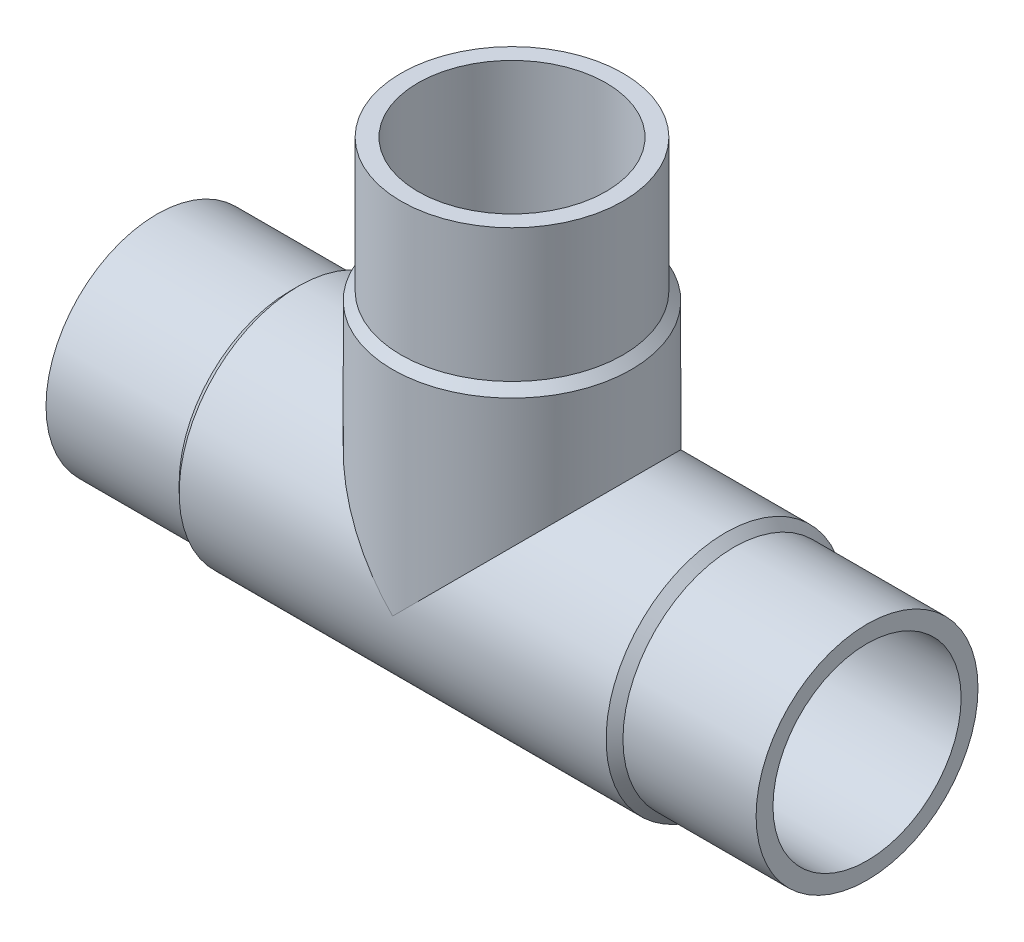
ISO-10303-21;
HEADER;
FILE_DESCRIPTION(('STEP AP214'),'2;1');
FILE_NAME('part.step','',(''),(''),'','','');
FILE_SCHEMA(('AUTOMOTIVE_DESIGN { 1 0 10303 214 1 1 1 1 }'));
ENDSEC;
DATA;
#1=APPLICATION_CONTEXT('core data for automotive mechanical design processes');
#2=APPLICATION_PROTOCOL_DEFINITION('international standard','automotive_design',2000,#1);
#3=PRODUCT_CONTEXT('',#1,'mechanical');
#4=PRODUCT('Part','Part','',(#3));
#5=PRODUCT_RELATED_PRODUCT_CATEGORY('part','',(#4));
#6=PRODUCT_DEFINITION_FORMATION('','',#4);
#7=PRODUCT_DEFINITION_CONTEXT('part definition',#1,'design');
#8=PRODUCT_DEFINITION('design','',#6,#7);
#9=PRODUCT_DEFINITION_SHAPE('','',#8);
#10=(LENGTH_UNIT() NAMED_UNIT(*) SI_UNIT(.MILLI.,.METRE.));
#11=(NAMED_UNIT(*) PLANE_ANGLE_UNIT() SI_UNIT($,.RADIAN.));
#12=(NAMED_UNIT(*) SI_UNIT($,.STERADIAN.) SOLID_ANGLE_UNIT());
#13=UNCERTAINTY_MEASURE_WITH_UNIT(LENGTH_MEASURE(1.E-05),#10,'distance_accuracy_value','');
#14=(GEOMETRIC_REPRESENTATION_CONTEXT(3) GLOBAL_UNCERTAINTY_ASSIGNED_CONTEXT((#13)) GLOBAL_UNIT_ASSIGNED_CONTEXT((#10,
#11,#12)) REPRESENTATION_CONTEXT('',''));
#15=CARTESIAN_POINT('',(0.,0.,0.));
#16=DIRECTION('',(0.,0.,1.));
#17=DIRECTION('',(1.,0.,0.));
#18=AXIS2_PLACEMENT_3D('',#15,#16,#17);
#19=CARTESIAN_POINT('',(-40.,40.,0.));
#20=DIRECTION('',(0.,1.,0.));
#21=DIRECTION('',(0.,0.,1.));
#22=AXIS2_PLACEMENT_3D('',#19,#20,#21);
#23=CYLINDRICAL_SURFACE('',#22,12.5);
#24=CARTESIAN_POINT('',(-40.,40.,0.));
#25=DIRECTION('',(0.,1.,0.));
#26=DIRECTION('',(0.,0.,1.));
#27=AXIS2_PLACEMENT_3D('',#24,#25,#26);
#28=CIRCLE('',#27,12.5);
#29=CARTESIAN_POINT('',(-40.,40.,12.5));
#30=VERTEX_POINT('',#29);
#31=EDGE_CURVE('E18',#30,#30,#28,.T.);
#32=ORIENTED_EDGE('',*,*,#31,.F.);
#33=EDGE_LOOP('',(#32));
#34=FACE_BOUND('',#33,.T.);
#35=CARTESIAN_POINT('',(-40.,25.,0.));
#36=DIRECTION('',(0.,1.,0.));
#37=DIRECTION('',(1.,0.,0.));
#38=AXIS2_PLACEMENT_3D('',#35,#36,#37);
#39=CIRCLE('',#38,12.5);
#40=CARTESIAN_POINT('',(-27.5,25.,0.));
#41=VERTEX_POINT('',#40);
#42=EDGE_CURVE('E71',#41,#41,#39,.F.);
#43=ORIENTED_EDGE('',*,*,#42,.F.);
#44=EDGE_LOOP('',(#43));
#45=FACE_BOUND('',#44,.T.);
#46=ADVANCED_FACE('F15',(#34,#45),#23,.T.);
#47=CARTESIAN_POINT('',(-40.,25.,0.));
#48=DIRECTION('',(0.,-1.,0.));
#49=DIRECTION('',(0.,0.,-1.));
#50=AXIS2_PLACEMENT_3D('',#47,#48,#49);
#51=CONICAL_SURFACE('',#50,12.5,0.785398163397448);
#52=CARTESIAN_POINT('',(-40.,24.05,0.));
#53=DIRECTION('',(0.,1.,0.));
#54=DIRECTION('',(1.,0.,0.));
#55=AXIS2_PLACEMENT_3D('',#52,#53,#54);
#56=CIRCLE('',#55,13.45);
#57=CARTESIAN_POINT('',(-26.55,24.05,0.));
#58=VERTEX_POINT('',#57);
#59=EDGE_CURVE('E60',#58,#58,#56,.F.);
#60=ORIENTED_EDGE('',*,*,#59,.F.);
#61=EDGE_LOOP('',(#60));
#62=FACE_BOUND('',#61,.T.);
#63=ORIENTED_EDGE('',*,*,#42,.T.);
#64=EDGE_LOOP('',(#63));
#65=FACE_BOUND('',#64,.T.);
#66=ADVANCED_FACE('F141',(#62,#65),#51,.T.);
#67=CARTESIAN_POINT('',(-15.,0.,0.));
#68=DIRECTION('',(-1.,0.,0.));
#69=DIRECTION('',(0.,0.,1.));
#70=AXIS2_PLACEMENT_3D('',#67,#68,#69);
#71=CYLINDRICAL_SURFACE('',#70,12.5);
#72=CARTESIAN_POINT('',(-15.,0.,0.));
#73=DIRECTION('',(1.,0.,0.));
#74=DIRECTION('',(0.,1.,0.));
#75=AXIS2_PLACEMENT_3D('',#72,#73,#74);
#76=CIRCLE('',#75,12.5);
#77=CARTESIAN_POINT('',(-15.,12.5,0.));
#78=VERTEX_POINT('',#77);
#79=EDGE_CURVE('E64',#78,#78,#76,.F.);
#80=ORIENTED_EDGE('',*,*,#79,.F.);
#81=EDGE_LOOP('',(#80));
#82=FACE_BOUND('',#81,.T.);
#83=CARTESIAN_POINT('',(0.,0.,0.));
#84=DIRECTION('',(-1.,0.,0.));
#85=DIRECTION('',(0.,0.,1.));
#86=AXIS2_PLACEMENT_3D('',#83,#84,#85);
#87=CIRCLE('',#86,12.5);
#88=CARTESIAN_POINT('',(0.,0.,12.5));
#89=VERTEX_POINT('',#88);
#90=EDGE_CURVE('E58',#89,#89,#87,.F.);
#91=ORIENTED_EDGE('',*,*,#90,.F.);
#92=EDGE_LOOP('',(#91));
#93=FACE_BOUND('',#92,.T.);
#94=ADVANCED_FACE('F136',(#82,#93),#71,.T.);
#95=CARTESIAN_POINT('',(-52.5,40.,12.6500021083112));
#96=DIRECTION('',(0.,1.,0.));
#97=DIRECTION('',(1.,0.,0.));
#98=AXIS2_PLACEMENT_3D('',#95,#96,#97);
#99=PLANE('',#98);
#100=CARTESIAN_POINT('',(-40.,40.,0.));
#101=DIRECTION('',(0.,1.,0.));
#102=DIRECTION('',(0.,0.,1.));
#103=AXIS2_PLACEMENT_3D('',#100,#101,#102);
#104=CIRCLE('',#103,10.6);
#105=CARTESIAN_POINT('',(-40.,40.,10.6));
#106=VERTEX_POINT('',#105);
#107=EDGE_CURVE('E52',#106,#106,#104,.T.);
#108=ORIENTED_EDGE('',*,*,#107,.F.);
#109=EDGE_LOOP('',(#108));
#110=FACE_BOUND('',#109,.T.);
#111=ORIENTED_EDGE('',*,*,#31,.T.);
#112=EDGE_LOOP('',(#111));
#113=FACE_BOUND('',#112,.T.);
#114=ADVANCED_FACE('F130',(#110,#113),#99,.T.);
#115=CARTESIAN_POINT('',(-15.,0.,0.));
#116=DIRECTION('',(-1.,0.,0.));
#117=DIRECTION('',(0.,0.,1.));
#118=AXIS2_PLACEMENT_3D('',#115,#116,#117);
#119=CONICAL_SURFACE('',#118,12.5,0.785398163397456);
#120=ORIENTED_EDGE('',*,*,#79,.T.);
#121=EDGE_LOOP('',(#120));
#122=FACE_BOUND('',#121,.T.);
#123=CARTESIAN_POINT('',(-15.95,0.,0.));
#124=DIRECTION('',(-1.,0.,0.));
#125=DIRECTION('',(0.,1.,0.));
#126=AXIS2_PLACEMENT_3D('',#123,#124,#125);
#127=CIRCLE('',#126,13.45);
#128=CARTESIAN_POINT('',(-15.95,13.45,0.));
#129=VERTEX_POINT('',#128);
#130=EDGE_CURVE('E49',#129,#129,#127,.T.);
#131=ORIENTED_EDGE('',*,*,#130,.F.);
#132=EDGE_LOOP('',(#131));
#133=FACE_BOUND('',#132,.T.);
#134=ADVANCED_FACE('F95',(#122,#133),#119,.T.);
#135=CARTESIAN_POINT('',(-40.,24.05,0.));
#136=DIRECTION('',(0.,1.,0.));
#137=DIRECTION('',(0.,0.,1.));
#138=AXIS2_PLACEMENT_3D('',#135,#136,#137);
#139=CYLINDRICAL_SURFACE('',#138,13.45);
#140=CARTESIAN_POINT('',(-40.,0.,0.));
#141=DIRECTION('',(0.707106781186547,0.707106781186547,0.));
#142=DIRECTION('',(-0.707106781186547,0.707106781186547,0.));
#143=AXIS2_PLACEMENT_3D('',#140,#141,#142);
#144=ELLIPSE('',#143,19.0211724139181,13.45);
#145=CARTESIAN_POINT('',(-40.,0.,13.45));
#146=VERTEX_POINT('',#145);
#147=CARTESIAN_POINT('',(-40.,0.,-13.45));
#148=VERTEX_POINT('',#147);
#149=EDGE_CURVE('E44',#146,#148,#144,.F.);
#150=ORIENTED_EDGE('',*,*,#149,.F.);
#151=CARTESIAN_POINT('',(-40.,0.,0.));
#152=DIRECTION('',(-0.707106781186547,0.707106781186547,0.));
#153=DIRECTION('',(0.707106781186547,0.707106781186547,0.));
#154=AXIS2_PLACEMENT_3D('',#151,#152,#153);
#155=ELLIPSE('',#154,19.0211724139181,13.45);
#156=EDGE_CURVE('E40',#148,#146,#155,.F.);
#157=ORIENTED_EDGE('',*,*,#156,.F.);
#158=EDGE_LOOP('',(#150,#157));
#159=FACE_BOUND('',#158,.T.);
#160=ORIENTED_EDGE('',*,*,#59,.T.);
#161=EDGE_LOOP('',(#160));
#162=FACE_BOUND('',#161,.T.);
#163=ADVANCED_FACE('F47',(#159,#162),#139,.T.);
#164=CARTESIAN_POINT('',(0.,12.5,12.6500021083112));
#165=DIRECTION('',(1.,0.,0.));
#166=DIRECTION('',(0.,-1.,0.));
#167=AXIS2_PLACEMENT_3D('',#164,#165,#166);
#168=PLANE('',#167);
#169=CARTESIAN_POINT('',(0.,0.,0.));
#170=DIRECTION('',(-1.,0.,0.));
#171=DIRECTION('',(0.,0.,1.));
#172=AXIS2_PLACEMENT_3D('',#169,#170,#171);
#173=CIRCLE('',#172,10.6);
#174=CARTESIAN_POINT('',(0.,0.,10.6));
#175=VERTEX_POINT('',#174);
#176=EDGE_CURVE('E45',#175,#175,#173,.F.);
#177=ORIENTED_EDGE('',*,*,#176,.F.);
#178=EDGE_LOOP('',(#177));
#179=FACE_BOUND('',#178,.T.);
#180=ORIENTED_EDGE('',*,*,#90,.T.);
#181=EDGE_LOOP('',(#180));
#182=FACE_BOUND('',#181,.T.);
#183=ADVANCED_FACE('F85',(#179,#182),#168,.T.);
#184=CARTESIAN_POINT('',(-40.,0.,0.));
#185=DIRECTION('',(0.,1.,0.));
#186=DIRECTION('',(0.,0.,1.));
#187=AXIS2_PLACEMENT_3D('',#184,#185,#186);
#188=CYLINDRICAL_SURFACE('',#187,10.6);
#189=CARTESIAN_POINT('',(-40.,0.,0.));
#190=DIRECTION('',(-0.707106781186547,-0.707106781186548,0.));
#191=DIRECTION('',(-0.707106781186548,0.707106781186547,0.));
#192=AXIS2_PLACEMENT_3D('',#189,#190,#191);
#193=ELLIPSE('',#192,14.9906637611548,10.6);
#194=CARTESIAN_POINT('',(-40.,0.,-10.6));
#195=VERTEX_POINT('',#194);
#196=CARTESIAN_POINT('',(-40.,0.,10.6));
#197=VERTEX_POINT('',#196);
#198=EDGE_CURVE('E78',#195,#197,#193,.F.);
#199=ORIENTED_EDGE('',*,*,#198,.F.);
#200=CARTESIAN_POINT('',(-40.,0.,0.));
#201=DIRECTION('',(-0.707106781186547,0.707106781186547,0.));
#202=DIRECTION('',(0.707106781186547,0.707106781186547,0.));
#203=AXIS2_PLACEMENT_3D('',#200,#201,#202);
#204=ELLIPSE('',#203,14.9906637611548,10.6);
#205=EDGE_CURVE('E32',#195,#197,#204,.F.);
#206=ORIENTED_EDGE('',*,*,#205,.T.);
#207=EDGE_LOOP('',(#199,#206));
#208=FACE_BOUND('',#207,.T.);
#209=ORIENTED_EDGE('',*,*,#107,.T.);
#210=EDGE_LOOP('',(#209));
#211=FACE_BOUND('',#210,.T.);
#212=ADVANCED_FACE('F87',(#208,#211),#188,.F.);
#213=CARTESIAN_POINT('',(-64.05,0.,0.));
#214=DIRECTION('',(-1.,0.,0.));
#215=DIRECTION('',(0.,0.,1.));
#216=AXIS2_PLACEMENT_3D('',#213,#214,#215);
#217=CYLINDRICAL_SURFACE('',#216,13.45);
#218=ORIENTED_EDGE('',*,*,#130,.T.);
#219=EDGE_LOOP('',(#218));
#220=FACE_BOUND('',#219,.T.);
#221=CARTESIAN_POINT('',(-64.05,0.,0.));
#222=DIRECTION('',(-1.,0.,0.));
#223=DIRECTION('',(0.,1.,0.));
#224=AXIS2_PLACEMENT_3D('',#221,#222,#223);
#225=CIRCLE('',#224,13.45);
#226=CARTESIAN_POINT('',(-64.05,13.45,0.));
#227=VERTEX_POINT('',#226);
#228=EDGE_CURVE('E77',#227,#227,#225,.T.);
#229=ORIENTED_EDGE('',*,*,#228,.F.);
#230=EDGE_LOOP('',(#229));
#231=FACE_BOUND('',#230,.T.);
#232=ORIENTED_EDGE('',*,*,#149,.T.);
#233=ORIENTED_EDGE('',*,*,#156,.T.);
#234=EDGE_LOOP('',(#232,#233));
#235=FACE_BOUND('',#234,.T.);
#236=ADVANCED_FACE('F43',(#220,#231,#235),#217,.T.);
#237=CARTESIAN_POINT('',(-40.,0.,0.));
#238=DIRECTION('',(-1.,0.,0.));
#239=DIRECTION('',(0.,-1.,0.));
#240=AXIS2_PLACEMENT_3D('',#237,#238,#239);
#241=CYLINDRICAL_SURFACE('',#240,10.6);
#242=ORIENTED_EDGE('',*,*,#205,.F.);
#243=ORIENTED_EDGE('',*,*,#198,.T.);
#244=EDGE_LOOP('',(#242,#243));
#245=FACE_BOUND('',#244,.T.);
#246=ORIENTED_EDGE('',*,*,#176,.T.);
#247=EDGE_LOOP('',(#246));
#248=FACE_BOUND('',#247,.T.);
#249=CARTESIAN_POINT('',(-80.,0.,0.));
#250=DIRECTION('',(-1.,0.,0.));
#251=DIRECTION('',(0.,-1.,0.));
#252=AXIS2_PLACEMENT_3D('',#249,#250,#251);
#253=CIRCLE('',#252,10.6);
#254=CARTESIAN_POINT('',(-80.,-10.6,0.));
#255=VERTEX_POINT('',#254);
#256=EDGE_CURVE('E74',#255,#255,#253,.F.);
#257=ORIENTED_EDGE('',*,*,#256,.F.);
#258=EDGE_LOOP('',(#257));
#259=FACE_BOUND('',#258,.T.);
#260=ADVANCED_FACE('F82',(#245,#248,#259),#241,.F.);
#261=CARTESIAN_POINT('',(-65.,0.,0.));
#262=DIRECTION('',(1.,0.,0.));
#263=DIRECTION('',(0.,0.,-1.));
#264=AXIS2_PLACEMENT_3D('',#261,#262,#263);
#265=CONICAL_SURFACE('',#264,12.5,0.785398163397454);
#266=ORIENTED_EDGE('',*,*,#228,.T.);
#267=EDGE_LOOP('',(#266));
#268=FACE_BOUND('',#267,.T.);
#269=CARTESIAN_POINT('',(-65.,0.,0.));
#270=DIRECTION('',(-1.,0.,0.));
#271=DIRECTION('',(0.,1.,0.));
#272=AXIS2_PLACEMENT_3D('',#269,#270,#271);
#273=CIRCLE('',#272,12.5);
#274=CARTESIAN_POINT('',(-65.,12.5,0.));
#275=VERTEX_POINT('',#274);
#276=EDGE_CURVE('E24',#275,#275,#273,.T.);
#277=ORIENTED_EDGE('',*,*,#276,.F.);
#278=EDGE_LOOP('',(#277));
#279=FACE_BOUND('',#278,.T.);
#280=ADVANCED_FACE('F105',(#268,#279),#265,.T.);
#281=CARTESIAN_POINT('',(-80.,-12.5,12.6500021083521));
#282=DIRECTION('',(-1.,0.,0.));
#283=DIRECTION('',(0.,1.,0.));
#284=AXIS2_PLACEMENT_3D('',#281,#282,#283);
#285=PLANE('',#284);
#286=ORIENTED_EDGE('',*,*,#256,.T.);
#287=EDGE_LOOP('',(#286));
#288=FACE_BOUND('',#287,.T.);
#289=CARTESIAN_POINT('',(-80.,0.,0.));
#290=DIRECTION('',(-1.,0.,0.));
#291=DIRECTION('',(0.,0.,1.));
#292=AXIS2_PLACEMENT_3D('',#289,#290,#291);
#293=CIRCLE('',#292,12.5);
#294=CARTESIAN_POINT('',(-80.,0.,12.5));
#295=VERTEX_POINT('',#294);
#296=EDGE_CURVE('E9',#295,#295,#293,.F.);
#297=ORIENTED_EDGE('',*,*,#296,.F.);
#298=EDGE_LOOP('',(#297));
#299=FACE_BOUND('',#298,.T.);
#300=ADVANCED_FACE('F99',(#288,#299),#285,.T.);
#301=CARTESIAN_POINT('',(-80.,0.,0.));
#302=DIRECTION('',(-1.,0.,0.));
#303=DIRECTION('',(0.,0.,1.));
#304=AXIS2_PLACEMENT_3D('',#301,#302,#303);
#305=CYLINDRICAL_SURFACE('',#304,12.5);
#306=ORIENTED_EDGE('',*,*,#276,.T.);
#307=EDGE_LOOP('',(#306));
#308=FACE_BOUND('',#307,.T.);
#309=ORIENTED_EDGE('',*,*,#296,.T.);
#310=EDGE_LOOP('',(#309));
#311=FACE_BOUND('',#310,.T.);
#312=ADVANCED_FACE('F97',(#308,#311),#305,.T.);
#313=CLOSED_SHELL('',(#46,#66,#94,#114,#134,#163,#183,#212,#236,#260,#280,#300,#312));
#314=MANIFOLD_SOLID_BREP('B1',#313);
#315=ADVANCED_BREP_SHAPE_REPRESENTATION('',(#18,#314),#14);
#316=SHAPE_DEFINITION_REPRESENTATION(#9,#315);
ENDSEC;
END-ISO-10303-21;
